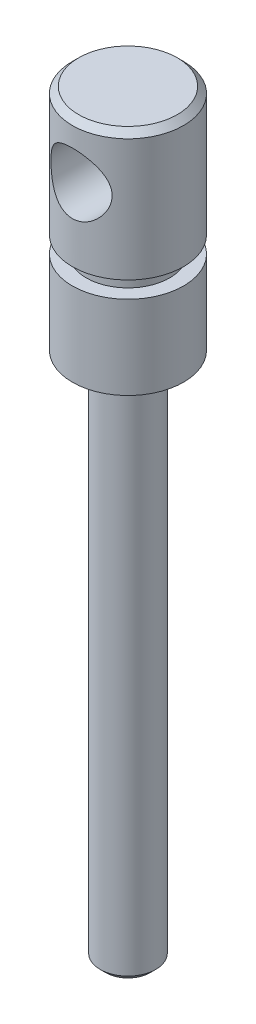
ISO-10303-21;
HEADER;
FILE_DESCRIPTION(('STEP AP214'),'2;1');
FILE_NAME('part.step','',(''),(''),'','','');
FILE_SCHEMA(('AUTOMOTIVE_DESIGN { 1 0 10303 214 1 1 1 1 }'));
ENDSEC;
DATA;
#1=APPLICATION_CONTEXT('core data for automotive mechanical design processes');
#2=APPLICATION_PROTOCOL_DEFINITION('international standard','automotive_design',2000,#1);
#3=PRODUCT_CONTEXT('',#1,'mechanical');
#4=PRODUCT('Part','Part','',(#3));
#5=PRODUCT_RELATED_PRODUCT_CATEGORY('part','',(#4));
#6=PRODUCT_DEFINITION_FORMATION('','',#4);
#7=PRODUCT_DEFINITION_CONTEXT('part definition',#1,'design');
#8=PRODUCT_DEFINITION('design','',#6,#7);
#9=PRODUCT_DEFINITION_SHAPE('','',#8);
#10=(LENGTH_UNIT() NAMED_UNIT(*) SI_UNIT(.MILLI.,.METRE.));
#11=(NAMED_UNIT(*) PLANE_ANGLE_UNIT() SI_UNIT($,.RADIAN.));
#12=(NAMED_UNIT(*) SI_UNIT($,.STERADIAN.) SOLID_ANGLE_UNIT());
#13=UNCERTAINTY_MEASURE_WITH_UNIT(LENGTH_MEASURE(1.E-05),#10,'distance_accuracy_value','');
#14=(GEOMETRIC_REPRESENTATION_CONTEXT(3) GLOBAL_UNCERTAINTY_ASSIGNED_CONTEXT((#13)) GLOBAL_UNIT_ASSIGNED_CONTEXT((#10,
#11,#12)) REPRESENTATION_CONTEXT('',''));
#15=CARTESIAN_POINT('',(0.,0.,0.));
#16=DIRECTION('',(0.,0.,1.));
#17=DIRECTION('',(1.,0.,0.));
#18=AXIS2_PLACEMENT_3D('',#15,#16,#17);
#19=CARTESIAN_POINT('',(0.,0.13,0.));
#20=DIRECTION('',(0.,-1.,0.));
#21=DIRECTION('',(0.,0.,-1.));
#22=AXIS2_PLACEMENT_3D('',#19,#20,#21);
#23=PLANE('',#22);
#24=CARTESIAN_POINT('',(0.,0.13,0.));
#25=DIRECTION('',(0.,-1.,0.));
#26=DIRECTION('',(0.,0.,-1.));
#27=AXIS2_PLACEMENT_3D('',#24,#25,#26);
#28=CIRCLE('',#27,8.86999999999997);
#29=CARTESIAN_POINT('',(0.,0.13,-8.86999999999997));
#30=VERTEX_POINT('',#29);
#31=EDGE_CURVE('E61',#30,#30,#28,.F.);
#32=ORIENTED_EDGE('',*,*,#31,.T.);
#33=EDGE_LOOP('',(#32));
#34=FACE_BOUND('',#33,.T.);
#35=ADVANCED_FACE('F38',(#34),#23,.F.);
#36=CARTESIAN_POINT('',(0.,-23.,0.));
#37=DIRECTION('',(0.,1.,0.));
#38=DIRECTION('',(0.,0.,1.));
#39=AXIS2_PLACEMENT_3D('',#36,#37,#38);
#40=CYLINDRICAL_SURFACE('',#39,10.);
#41=CARTESIAN_POINT('',(0.,-4.5,-10.));
#42=CARTESIAN_POINT('',(0.142841752058878,-4.49999850019387,-10.0000013253171));
#43=CARTESIAN_POINT('',(0.285665986079781,-4.50556976328347,-9.9969335195706));
#44=CARTESIAN_POINT('',(0.570239689293179,-4.52777963257996,-9.98474372414085));
#45=CARTESIAN_POINT('',(0.711988829035868,-4.54442150283317,-9.97561994892361));
#46=CARTESIAN_POINT('',(0.993411840442093,-4.58858219680576,-9.95153761632946));
#47=CARTESIAN_POINT('',(1.1330835984815,-4.61611140422938,-9.9365734889463));
#48=CARTESIAN_POINT('',(1.40927178286025,-4.68171923059871,-9.9011791338125));
#49=CARTESIAN_POINT('',(1.54578689583191,-4.71980215795051,-9.88074667380979));
#50=CARTESIAN_POINT('',(1.81410275102406,-4.80588917672703,-9.83501204865348));
#51=CARTESIAN_POINT('',(1.94592224152469,-4.85384697089414,-9.80973264463814));
#52=CARTESIAN_POINT('',(2.20476755536611,-4.95930983666868,-9.75482138133249));
#53=CARTESIAN_POINT('',(2.33179154281556,-5.01681852011033,-9.72518787595395));
#54=CARTESIAN_POINT('',(2.70454712408485,-5.20287226428519,-9.63072907142522));
#55=CARTESIAN_POINT('',(2.94222352099017,-5.34502983412092,-9.56029904906485));
#56=CARTESIAN_POINT('',(3.40709885210692,-5.67240495150373,-9.40510071299984));
#57=CARTESIAN_POINT('',(3.63245231290911,-5.85991191186389,-9.31967934451281));
#58=CARTESIAN_POINT('',(4.05027005649351,-6.26761851241972,-9.14585008459779));
#59=CARTESIAN_POINT('',(4.24270359328259,-6.48784835981978,-9.05743949262799));
#60=CARTESIAN_POINT('',(4.60842590708714,-6.98081944082922,-8.87738336369874));
#61=CARTESIAN_POINT('',(4.77796075069635,-7.25659650259854,-8.78627724878626));
#62=CARTESIAN_POINT('',(4.99508838788049,-7.69229574182051,-8.6634891383539));
#63=CARTESIAN_POINT('',(5.06128412115967,-7.84125363313554,-8.6248612077339));
#64=CARTESIAN_POINT('',(5.1805658273668,-8.14570391878355,-8.55374495363447));
#65=CARTESIAN_POINT('',(5.23366028561748,-8.30119200691545,-8.52125265949637));
#66=CARTESIAN_POINT('',(5.32309800232022,-8.60769824603289,-8.46565009064031));
#67=CARTESIAN_POINT('',(5.3602810293766,-8.75838806881627,-8.4420802476158));
#68=CARTESIAN_POINT('',(5.42187353079098,-9.06327700232522,-8.40265611303222));
#69=CARTESIAN_POINT('',(5.4462905446175,-9.2174739854766,-8.38679726783014));
#70=CARTESIAN_POINT('',(5.48192299182762,-9.52787509750639,-8.36355045676607));
#71=CARTESIAN_POINT('',(5.49315107892035,-9.68407715694516,-8.35615437174649));
#72=CARTESIAN_POINT('',(5.50222552899403,-9.99702904786448,-8.35018254815687));
#73=CARTESIAN_POINT('',(5.50007372257812,-10.1537788014781,-8.35160560297439));
#74=CARTESIAN_POINT('',(5.48378840679718,-10.4423238070741,-8.362304177594));
#75=CARTESIAN_POINT('',(5.47153363404035,-10.5742765234424,-8.37034812856275));
#76=CARTESIAN_POINT('',(5.43762330738641,-10.8365015697627,-8.39241700242708));
#77=CARTESIAN_POINT('',(5.41596489317585,-10.9667733760064,-8.40644374509048));
#78=CARTESIAN_POINT('',(5.3635189397094,-11.2247394112197,-8.44000182353256));
#79=CARTESIAN_POINT('',(5.3327314211979,-11.3524336460458,-8.45953314680297));
#80=CARTESIAN_POINT('',(5.26237647986399,-11.604539228811,-8.50347627264488));
#81=CARTESIAN_POINT('',(5.22280555536868,-11.7289492452378,-8.52789002130324));
#82=CARTESIAN_POINT('',(5.08962534035009,-12.1014586579969,-8.60852268821012));
#83=CARTESIAN_POINT('',(4.98264689654881,-12.3434858659304,-8.67139237679696));
#84=CARTESIAN_POINT('',(4.73690186702311,-12.8072783466794,-8.80803472474407));
#85=CARTESIAN_POINT('',(4.59812156040827,-13.0290348157599,-8.88181208532226));
#86=CARTESIAN_POINT('',(4.2672928416758,-13.4829626086818,-9.04596391719774));
#87=CARTESIAN_POINT('',(4.07029459887438,-13.7112562928674,-9.13712038619752));
#88=CARTESIAN_POINT('',(3.6407717221147,-14.1334525036102,-9.31659078642609));
#89=CARTESIAN_POINT('',(3.40822298418385,-14.3273315020843,-9.40490273945531));
#90=CARTESIAN_POINT('',(3.02769936677207,-14.5944831341532,-9.53166449287198));
#91=CARTESIAN_POINT('',(2.89078692652741,-14.6818679349817,-9.5741788439289));
#92=CARTESIAN_POINT('',(2.60880759779843,-14.8446455979222,-9.65482165281564));
#93=CARTESIAN_POINT('',(2.46374422978986,-14.9200435842003,-9.69295198280235));
#94=CARTESIAN_POINT('',(2.16643764569558,-15.0580031092139,-9.76370281263216));
#95=CARTESIAN_POINT('',(2.01419808546738,-15.1205710990037,-9.79632608001704));
#96=CARTESIAN_POINT('',(1.70360443439009,-15.2321070292491,-9.85508466904527));
#97=CARTESIAN_POINT('',(1.54525121703053,-15.2810769044065,-9.88122091358791));
#98=CARTESIAN_POINT('',(1.23876719934142,-15.3607969685821,-9.92406797790065));
#99=CARTESIAN_POINT('',(1.09105745977757,-15.3928190643549,-9.94142981891384));
#100=CARTESIAN_POINT('',(0.792902539913914,-15.4446481084313,-9.96963983396893));
#101=CARTESIAN_POINT('',(0.642457675275715,-15.4644564572292,-9.98048875481365));
#102=CARTESIAN_POINT('',(0.340185751134489,-15.4915652616398,-9.99535695727727));
#103=CARTESIAN_POINT('',(0.188359431905525,-15.4988720604122,-9.99937970241998));
#104=CARTESIAN_POINT('',(-0.115397784685615,-15.5008859641353,-10.000487212106));
#105=CARTESIAN_POINT('',(-0.267328674645216,-15.4955938843381,-9.99757242556526));
#106=CARTESIAN_POINT('',(-0.555090017146402,-15.4736288472659,-9.98551656359033));
#107=CARTESIAN_POINT('',(-0.691038404175576,-15.458122734434,-9.97701403759353));
#108=CARTESIAN_POINT('',(-0.961013435543871,-15.4171117329113,-9.95463729187315));
#109=CARTESIAN_POINT('',(-1.09503946994524,-15.3916037404492,-9.94076140471112));
#110=CARTESIAN_POINT('',(-1.36019343131532,-15.3308881062874,-9.90796226724198));
#111=CARTESIAN_POINT('',(-1.49132227054391,-15.2956835662156,-9.88904063097659));
#112=CARTESIAN_POINT('',(-1.74998258370257,-15.2159263412598,-9.8465602681033));
#113=CARTESIAN_POINT('',(-1.87751263214374,-15.171370009475,-9.82299973269512));
#114=CARTESIAN_POINT('',(-2.13100055929735,-15.0722538934694,-9.77117873265241));
#115=CARTESIAN_POINT('',(-2.25686186442489,-15.0174953062352,-9.74282613973581));
#116=CARTESIAN_POINT('',(-2.50344497450166,-14.8991310762515,-9.68240175637615));
#117=CARTESIAN_POINT('',(-2.62416502847458,-14.8355224503868,-9.65032871247552));
#118=CARTESIAN_POINT('',(-2.97774605394808,-14.6321600515731,-9.54950153528061));
#119=CARTESIAN_POINT('',(-3.20217216376082,-14.479812789945,-9.47610871849305));
#120=CARTESIAN_POINT('',(-3.64857882136404,-14.1264715796,-9.31399109156981));
#121=CARTESIAN_POINT('',(-3.86747318592924,-13.921941051183,-9.22446967649404));
#122=CARTESIAN_POINT('',(-4.16880320735541,-13.5907416514808,-9.09028347654795));
#123=CARTESIAN_POINT('',(-4.26481547517286,-13.4761656220196,-9.04553232220247));
#124=CARTESIAN_POINT('',(-4.44742755665807,-13.2392510702113,-8.9571569588291));
#125=CARTESIAN_POINT('',(-4.5340257104432,-13.1169111849557,-8.91353294956809));
#126=CARTESIAN_POINT('',(-4.70364737374316,-12.85515161135,-8.82527898219404));
#127=CARTESIAN_POINT('',(-4.78586336984146,-12.7151442300633,-8.78083658924528));
#128=CARTESIAN_POINT('',(-4.938007141994,-12.4274565011473,-8.6961866776151));
#129=CARTESIAN_POINT('',(-5.00794079563639,-12.279779867639,-8.65597713705672));
#130=CARTESIAN_POINT('',(-5.13475179600474,-11.9776591538154,-8.58135986731129));
#131=CARTESIAN_POINT('',(-5.19164105655858,-11.823221403429,-8.54694685167459));
#132=CARTESIAN_POINT('',(-5.29164807133967,-11.5085422536272,-8.4853944161148));
#133=CARTESIAN_POINT('',(-5.33476840114518,-11.3483019458735,-8.45825363602035));
#134=CARTESIAN_POINT('',(-5.40303118984829,-11.0391483862094,-8.41479223555946));
#135=CARTESIAN_POINT('',(-5.42951066498988,-10.8906418160296,-8.39767807342412));
#136=CARTESIAN_POINT('',(-5.47021149205792,-10.5912680666414,-8.37122340830919));
#137=CARTESIAN_POINT('',(-5.48443375353874,-10.4404010634365,-8.36188232852482));
#138=CARTESIAN_POINT('',(-5.5003578433741,-10.1378320936561,-8.35141637552306));
#139=CARTESIAN_POINT('',(-5.50206881956723,-9.98613081830971,-8.35028549928033));
#140=CARTESIAN_POINT('',(-5.49296232983145,-9.6832787642378,-8.35627878087188));
#141=CARTESIAN_POINT('',(-5.48214589689606,-9.53212794115363,-8.36340225806316));
#142=CARTESIAN_POINT('',(-5.45050665725191,-9.25233409894887,-8.38404884662754));
#143=CARTESIAN_POINT('',(-5.43125166885692,-9.12343564357155,-8.39656541507773));
#144=CARTESIAN_POINT('',(-5.38380329531335,-8.86793643292143,-8.42706636056067));
#145=CARTESIAN_POINT('',(-5.35560704402958,-8.74133642819722,-8.44505249079367));
#146=CARTESIAN_POINT('',(-5.25805956141963,-8.36614667214669,-8.50639672586411));
#147=CARTESIAN_POINT('',(-5.17573170161389,-8.12201288344863,-8.55715312962815));
#148=CARTESIAN_POINT('',(-4.97351417539059,-7.63616312742535,-8.67632720331983));
#149=CARTESIAN_POINT('',(-4.851632703989,-7.39551113769708,-8.74563621099548));
#150=CARTESIAN_POINT('',(-4.57561608218593,-6.93642214235754,-8.89315570661007));
#151=CARTESIAN_POINT('',(-4.42146381549143,-6.71799701751396,-8.9713709082756));
#152=CARTESIAN_POINT('',(-4.05717828293991,-6.27383716290006,-9.14253204899318));
#153=CARTESIAN_POINT('',(-3.84205672204817,-6.05233054284565,-9.235864108763));
#154=CARTESIAN_POINT('',(-3.37593042311172,-5.64702723083797,-9.4162312520407));
#155=CARTESIAN_POINT('',(-3.12490013907636,-5.4632576141827,-9.50326178558824));
#156=CARTESIAN_POINT('',(-2.72071902073227,-5.21734312128358,-9.62385148160563));
#157=CARTESIAN_POINT('',(-2.57870041732792,-5.13926526969409,-9.66296672375161));
#158=CARTESIAN_POINT('',(-2.28727806087811,-4.99553055177587,-9.73606040387869));
#159=CARTESIAN_POINT('',(-2.13787797587978,-4.92986759293369,-9.7700413598182));
#160=CARTESIAN_POINT('',(-1.83300600966548,-4.81186352509766,-9.83179734063237));
#161=CARTESIAN_POINT('',(-1.67754638551483,-4.75949698490882,-9.85958419992875));
#162=CARTESIAN_POINT('',(-1.36162430458018,-4.66868001570659,-9.90815319038245));
#163=CARTESIAN_POINT('',(-1.2011645142698,-4.63022230284775,-9.92893898749869));
#164=CARTESIAN_POINT('',(-0.868435169900309,-4.56622150489788,-9.96369342403182));
#165=CARTESIAN_POINT('',(-0.695978548540532,-4.54142911738252,-9.97726455865953));
#166=CARTESIAN_POINT('',(-0.349005884743478,-4.50831939989647,-9.99541697228057));
#167=CARTESIAN_POINT('',(-0.174489872071037,-4.50000183210425,-9.99999838104469));
#168=CARTESIAN_POINT('',(0.,-4.5,-10.));
#169=B_SPLINE_CURVE_WITH_KNOTS('',3,(#41,#42,#43,#44,#45,#46,#47,#48,#49,#50,#51,#52,#53,#54,
#55,#56,#57,#58,#59,#60,#61,#62,#63,#64,#65,#66,#67,#68,#69,#70,#71,#72,#73,#74,#75,#76,#77,#78,
#79,#80,#81,#82,#83,#84,#85,#86,#87,#88,#89,#90,#91,#92,#93,#94,#95,#96,#97,#98,#99,#100,#101,
#102,#103,#104,#105,#106,#107,#108,#109,#110,#111,#112,#113,#114,#115,#116,#117,#118,#119,#120,
#121,#122,#123,#124,#125,#126,#127,#128,#129,#130,#131,#132,#133,#134,#135,#136,#137,#138,#139,
#140,#141,#142,#143,#144,#145,#146,#147,#148,#149,#150,#151,#152,#153,#154,#155,#156,#157,#158,
#159,#160,#161,#162,#163,#164,#165,#166,#167,#168),.UNSPECIFIED.,.T.,.F.,(4,2,2,2,2,2,2,2,2,2,2,
2,2,2,2,2,2,2,2,2,2,2,2,2,2,2,2,2,2,2,2,2,2,2,2,2,2,2,2,2,2,2,2,2,2,2,2,2,2,2,2,2,2,2,2,2,2,2,2,
2,2,2,2,4),(0.,0.42835450083162,0.856835353269251,1.28572585498715,1.71479170373485,
2.14188994581636,2.56915007181696,3.42284428470344,4.3352646920303,5.24853266826638,
6.25177572751265,6.75372702641161,7.2553523673698,7.72561526965103,8.19560012515658,
8.6651336989287,9.13460303372058,9.53242317074401,9.93036439791497,10.3283047208362,
10.7264039761387,11.5389600350193,12.3518673328937,13.293040231005,14.2348541175191,
14.7379644883097,15.2408592060021,15.743500439655,16.2460701222303,16.7018447273943,
17.1575670612581,17.6130580975835,18.06851966066,18.479320562304,18.8902490442125,
19.301046235061,19.7120039223647,20.1320176181854,20.552173234127,21.3920151581045,
22.3258728342409,22.7936061040557,23.2614217106041,23.7657769639548,24.269890201756,
24.7735411676835,25.2770978667837,25.7318681051628,26.1866045941192,26.6410085614969,
27.0953750619945,27.4877060268678,27.8801628813624,28.6646145595203,29.4971139726443,
30.3300560637595,31.2936579568471,32.2579488115965,32.7575199605934,33.2568453089076,
33.75520831138,34.2533099493803,34.7765785312484,35.299839559441),.UNSPECIFIED.);
#170=CARTESIAN_POINT('',(0.,-4.5,-10.));
#171=VERTEX_POINT('',#170);
#172=EDGE_CURVE('E11',#171,#171,#169,.T.);
#173=ORIENTED_EDGE('',*,*,#172,.F.);
#174=EDGE_LOOP('',(#173));
#175=FACE_BOUND('',#174,.T.);
#176=CARTESIAN_POINT('',(0.,-15.5,10.));
#177=CARTESIAN_POINT('',(0.142841752058878,-15.5000014998061,10.0000013253171));
#178=CARTESIAN_POINT('',(0.285665986079781,-15.4944302367165,9.9969335195706));
#179=CARTESIAN_POINT('',(0.570239689293178,-15.47222036742,9.98474372414085));
#180=CARTESIAN_POINT('',(0.711988829035868,-15.4555784971668,9.97561994892361));
#181=CARTESIAN_POINT('',(0.993411840442093,-15.4114178031942,9.95153761632946));
#182=CARTESIAN_POINT('',(1.1330835984815,-15.3838885957706,9.9365734889463));
#183=CARTESIAN_POINT('',(1.40927178286025,-15.3182807694013,9.9011791338125));
#184=CARTESIAN_POINT('',(1.54578689583191,-15.2801978420495,9.88074667380979));
#185=CARTESIAN_POINT('',(1.81410275102406,-15.194110823273,9.83501204865348));
#186=CARTESIAN_POINT('',(1.9459222415247,-15.1461530291059,9.80973264463814));
#187=CARTESIAN_POINT('',(2.20476755536612,-15.0406901633313,9.75482138133249));
#188=CARTESIAN_POINT('',(2.33179154281557,-14.9831814798897,9.72518787595395));
#189=CARTESIAN_POINT('',(2.70454712408485,-14.7971277357148,9.63072907142522));
#190=CARTESIAN_POINT('',(2.94222352099017,-14.6549701658791,9.56029904906485));
#191=CARTESIAN_POINT('',(3.40709885210692,-14.3275950484963,9.40510071299984));
#192=CARTESIAN_POINT('',(3.63245231290912,-14.1400880881361,9.31967934451281));
#193=CARTESIAN_POINT('',(4.05027005649351,-13.7323814875803,9.14585008459779));
#194=CARTESIAN_POINT('',(4.24270359328259,-13.5121516401802,9.05743949262799));
#195=CARTESIAN_POINT('',(4.60842590708714,-13.0191805591708,8.87738336369874));
#196=CARTESIAN_POINT('',(4.77796075069635,-12.7434034974015,8.78627724878626));
#197=CARTESIAN_POINT('',(4.99508838788049,-12.3077042581795,8.6634891383539));
#198=CARTESIAN_POINT('',(5.06128412115967,-12.1587463668645,8.6248612077339));
#199=CARTESIAN_POINT('',(5.1805658273668,-11.8542960812165,8.55374495363447));
#200=CARTESIAN_POINT('',(5.23366028561748,-11.6988079930846,8.52125265949637));
#201=CARTESIAN_POINT('',(5.32309800232022,-11.3923017539671,8.46565009064031));
#202=CARTESIAN_POINT('',(5.3602810293766,-11.2416119311837,8.44208024761579));
#203=CARTESIAN_POINT('',(5.42187353079098,-10.9367229976748,8.40265611303222));
#204=CARTESIAN_POINT('',(5.4462905446175,-10.7825260145234,8.38679726783014));
#205=CARTESIAN_POINT('',(5.48192299182762,-10.4721249024936,8.36355045676607));
#206=CARTESIAN_POINT('',(5.49315107892035,-10.3159228430548,8.35615437174649));
#207=CARTESIAN_POINT('',(5.50222552899403,-10.0029709521355,8.35018254815687));
#208=CARTESIAN_POINT('',(5.50007372257812,-9.84622119852193,8.35160560297439));
#209=CARTESIAN_POINT('',(5.48378840679718,-9.55767619292588,8.362304177594));
#210=CARTESIAN_POINT('',(5.47153363404035,-9.4257234765576,8.37034812856275));
#211=CARTESIAN_POINT('',(5.43762330738641,-9.16349843023727,8.39241700242708));
#212=CARTESIAN_POINT('',(5.41596489317585,-9.03322662399361,8.40644374509048));
#213=CARTESIAN_POINT('',(5.3635189397094,-8.7752605887803,8.44000182353256));
#214=CARTESIAN_POINT('',(5.3327314211979,-8.64756635395425,8.45953314680297));
#215=CARTESIAN_POINT('',(5.26237647986399,-8.39546077118898,8.50347627264488));
#216=CARTESIAN_POINT('',(5.22280555536868,-8.27105075476222,8.52789002130324));
#217=CARTESIAN_POINT('',(5.08962534035009,-7.89854134200311,8.60852268821013));
#218=CARTESIAN_POINT('',(4.9826468965488,-7.65651413406962,8.67139237679696));
#219=CARTESIAN_POINT('',(4.73690186702311,-7.19272165332061,8.80803472474407));
#220=CARTESIAN_POINT('',(4.59812156040827,-6.97096518424011,8.88181208532226));
#221=CARTESIAN_POINT('',(4.2672928416758,-6.51703739131821,9.04596391719774));
#222=CARTESIAN_POINT('',(4.07029459887438,-6.28874370713259,9.13712038619752));
#223=CARTESIAN_POINT('',(3.6407717221147,-5.86654749638984,9.31659078642609));
#224=CARTESIAN_POINT('',(3.40822298418385,-5.67266849791574,9.40490273945531));
#225=CARTESIAN_POINT('',(3.02769936677207,-5.40551686584682,9.53166449287198));
#226=CARTESIAN_POINT('',(2.89078692652741,-5.31813206501834,9.5741788439289));
#227=CARTESIAN_POINT('',(2.60880759779843,-5.15535440207785,9.65482165281565));
#228=CARTESIAN_POINT('',(2.46374422978986,-5.07995641579975,9.69295198280235));
#229=CARTESIAN_POINT('',(2.16643764569558,-4.94199689078608,9.76370281263216));
#230=CARTESIAN_POINT('',(2.01419808546739,-4.87942890099632,9.79632608001703));
#231=CARTESIAN_POINT('',(1.70360443439009,-4.76789297075095,9.85508466904527));
#232=CARTESIAN_POINT('',(1.54525121703053,-4.71892309559352,9.88122091358791));
#233=CARTESIAN_POINT('',(1.23876719934143,-4.6392030314179,9.92406797790066));
#234=CARTESIAN_POINT('',(1.09105745977757,-4.60718093564513,9.94142981891384));
#235=CARTESIAN_POINT('',(0.792902539913916,-4.55535189156866,9.96963983396893));
#236=CARTESIAN_POINT('',(0.642457675275716,-4.53554354277079,9.98048875481365));
#237=CARTESIAN_POINT('',(0.34018575113449,-4.50843473836024,9.99535695727727));
#238=CARTESIAN_POINT('',(0.188359431905526,-4.50112793958785,9.99937970241998));
#239=CARTESIAN_POINT('',(-0.115397784685615,-4.49911403586467,10.000487212106));
#240=CARTESIAN_POINT('',(-0.267328674645215,-4.50440611566188,9.99757242556526));
#241=CARTESIAN_POINT('',(-0.555090017146401,-4.52637115273406,9.98551656359033));
#242=CARTESIAN_POINT('',(-0.691038404175576,-4.54187726556599,9.97701403759353));
#243=CARTESIAN_POINT('',(-0.961013435543871,-4.58288826708869,9.95463729187315));
#244=CARTESIAN_POINT('',(-1.09503946994524,-4.60839625955085,9.94076140471112));
#245=CARTESIAN_POINT('',(-1.36019343131532,-4.66911189371264,9.90796226724198));
#246=CARTESIAN_POINT('',(-1.49132227054391,-4.70431643378442,9.88904063097659));
#247=CARTESIAN_POINT('',(-1.74998258370257,-4.78407365874023,9.8465602681033));
#248=CARTESIAN_POINT('',(-1.87751263214374,-4.82862999052503,9.82299973269512));
#249=CARTESIAN_POINT('',(-2.13100055929735,-4.92774610653062,9.77117873265241));
#250=CARTESIAN_POINT('',(-2.25686186442489,-4.98250469376485,9.74282613973581));
#251=CARTESIAN_POINT('',(-2.50344497450167,-5.10086892374848,9.68240175637615));
#252=CARTESIAN_POINT('',(-2.62416502847458,-5.16447754961322,9.65032871247552));
#253=CARTESIAN_POINT('',(-2.97774605394808,-5.36783994842687,9.5495015352806));
#254=CARTESIAN_POINT('',(-3.20217216376082,-5.52018721005503,9.47610871849305));
#255=CARTESIAN_POINT('',(-3.64857882136404,-5.8735284204,9.31399109156981));
#256=CARTESIAN_POINT('',(-3.86747318592924,-6.07805894881699,9.22446967649404));
#257=CARTESIAN_POINT('',(-4.16880320735541,-6.40925834851919,9.09028347654795));
#258=CARTESIAN_POINT('',(-4.26481547517286,-6.52383437798036,9.04553232220247));
#259=CARTESIAN_POINT('',(-4.44742755665807,-6.76074892978866,8.9571569588291));
#260=CARTESIAN_POINT('',(-4.5340257104432,-6.88308881504427,8.91353294956809));
#261=CARTESIAN_POINT('',(-4.70364737374316,-7.14484838864995,8.82527898219404));
#262=CARTESIAN_POINT('',(-4.78586336984146,-7.28485576993668,8.78083658924528));
#263=CARTESIAN_POINT('',(-4.938007141994,-7.57254349885269,8.6961866776151));
#264=CARTESIAN_POINT('',(-5.00794079563639,-7.72022013236097,8.65597713705672));
#265=CARTESIAN_POINT('',(-5.13475179600474,-8.02234084618458,8.58135986731129));
#266=CARTESIAN_POINT('',(-5.19164105655858,-8.17677859657105,8.54694685167459));
#267=CARTESIAN_POINT('',(-5.29164807133967,-8.49145774637282,8.4853944161148));
#268=CARTESIAN_POINT('',(-5.33476840114518,-8.65169805412653,8.45825363602035));
#269=CARTESIAN_POINT('',(-5.40303118984829,-8.96085161379061,8.41479223555946));
#270=CARTESIAN_POINT('',(-5.42951066498988,-9.10935818397044,8.39767807342412));
#271=CARTESIAN_POINT('',(-5.47021149205792,-9.40873193335861,8.37122340830919));
#272=CARTESIAN_POINT('',(-5.48443375353874,-9.55959893656349,8.36188232852482));
#273=CARTESIAN_POINT('',(-5.5003578433741,-9.8621679063439,8.35141637552306));
#274=CARTESIAN_POINT('',(-5.50206881956723,-10.0138691816903,8.35028549928033));
#275=CARTESIAN_POINT('',(-5.49296232983145,-10.3167212357622,8.35627878087188));
#276=CARTESIAN_POINT('',(-5.48214589689606,-10.4678720588464,8.36340225806315));
#277=CARTESIAN_POINT('',(-5.45050665725191,-10.7476659010511,8.38404884662754));
#278=CARTESIAN_POINT('',(-5.43125166885693,-10.8765643564285,8.39656541507773));
#279=CARTESIAN_POINT('',(-5.38380329531335,-11.1320635670786,8.42706636056067));
#280=CARTESIAN_POINT('',(-5.35560704402958,-11.2586635718028,8.44505249079367));
#281=CARTESIAN_POINT('',(-5.25805956141963,-11.6338533278533,8.50639672586411));
#282=CARTESIAN_POINT('',(-5.17573170161389,-11.8779871165514,8.55715312962815));
#283=CARTESIAN_POINT('',(-4.9735141753906,-12.3638368725746,8.67632720331983));
#284=CARTESIAN_POINT('',(-4.851632703989,-12.6044888623029,8.74563621099547));
#285=CARTESIAN_POINT('',(-4.57561608218593,-13.0635778576425,8.89315570661007));
#286=CARTESIAN_POINT('',(-4.42146381549143,-13.282002982486,8.9713709082756));
#287=CARTESIAN_POINT('',(-4.05717828293991,-13.7261628370999,9.14253204899318));
#288=CARTESIAN_POINT('',(-3.84205672204817,-13.9476694571544,9.235864108763));
#289=CARTESIAN_POINT('',(-3.37593042311172,-14.352972769162,9.4162312520407));
#290=CARTESIAN_POINT('',(-3.12490013907636,-14.5367423858173,9.50326178558824));
#291=CARTESIAN_POINT('',(-2.72071902073228,-14.7826568787164,9.62385148160562));
#292=CARTESIAN_POINT('',(-2.57870041732792,-14.8607347303059,9.66296672375161));
#293=CARTESIAN_POINT('',(-2.28727806087812,-15.0044694482241,9.73606040387869));
#294=CARTESIAN_POINT('',(-2.13787797587978,-15.0701324070663,9.7700413598182));
#295=CARTESIAN_POINT('',(-1.83300600966548,-15.1881364749023,9.83179734063238));
#296=CARTESIAN_POINT('',(-1.67754638551484,-15.2405030150912,9.85958419992875));
#297=CARTESIAN_POINT('',(-1.36162430458018,-15.3313199842934,9.90815319038245));
#298=CARTESIAN_POINT('',(-1.2011645142698,-15.3697776971522,9.92893898749869));
#299=CARTESIAN_POINT('',(-0.868435169900308,-15.4337784951021,9.96369342403182));
#300=CARTESIAN_POINT('',(-0.69597854854053,-15.4585708826175,9.97726455865953));
#301=CARTESIAN_POINT('',(-0.349005884743477,-15.4916806001035,9.99541697228057));
#302=CARTESIAN_POINT('',(-0.174489872071037,-15.4999981678958,9.99999838104469));
#303=CARTESIAN_POINT('',(0.,-15.5,10.));
#304=B_SPLINE_CURVE_WITH_KNOTS('',3,(#176,#177,#178,#179,#180,#181,#182,#183,#184,#185,#186,
#187,#188,#189,#190,#191,#192,#193,#194,#195,#196,#197,#198,#199,#200,#201,#202,#203,#204,#205,
#206,#207,#208,#209,#210,#211,#212,#213,#214,#215,#216,#217,#218,#219,#220,#221,#222,#223,#224,
#225,#226,#227,#228,#229,#230,#231,#232,#233,#234,#235,#236,#237,#238,#239,#240,#241,#242,#243,
#244,#245,#246,#247,#248,#249,#250,#251,#252,#253,#254,#255,#256,#257,#258,#259,#260,#261,#262,
#263,#264,#265,#266,#267,#268,#269,#270,#271,#272,#273,#274,#275,#276,#277,#278,#279,#280,#281,
#282,#283,#284,#285,#286,#287,#288,#289,#290,#291,#292,#293,#294,#295,#296,#297,#298,#299,#300,
#301,#302,#303),.UNSPECIFIED.,.T.,.F.,(4,2,2,2,2,2,2,2,2,2,2,2,2,2,2,2,2,2,2,2,2,2,2,2,2,2,2,2,
2,2,2,2,2,2,2,2,2,2,2,2,2,2,2,2,2,2,2,2,2,2,2,2,2,2,2,2,2,2,2,2,2,2,2,4),(0.,0.42835450083162,
0.85683535326925,1.28572585498715,1.71479170373485,2.14188994581637,2.56915007181696,
3.42284428470344,4.3352646920303,5.24853266826639,6.25177572751265,6.75372702641161,
7.25535236736979,7.72561526965102,8.19560012515658,8.6651336989287,9.13460303372058,
9.53242317074401,9.93036439791497,10.3283047208362,10.7264039761387,11.5389600350193,
12.3518673328937,13.293040231005,14.2348541175191,14.7379644883097,15.2408592060021,
15.743500439655,16.2460701222303,16.7018447273943,17.1575670612581,17.6130580975835,
18.06851966066,18.479320562304,18.8902490442125,19.301046235061,19.7120039223647,
20.1320176181854,20.552173234127,21.3920151581045,22.3258728342409,22.7936061040557,
23.2614217106041,23.7657769639548,24.269890201756,24.7735411676835,25.2770978667837,
25.7318681051628,26.1866045941192,26.6410085614969,27.0953750619945,27.4877060268677,
27.8801628813624,28.6646145595203,29.4971139726443,30.3300560637595,31.2936579568471,
32.2579488115965,32.7575199605934,33.2568453089076,33.75520831138,34.2533099493803,
34.7765785312483,35.299839559441),.UNSPECIFIED.);
#305=CARTESIAN_POINT('',(0.,-15.5,10.));
#306=VERTEX_POINT('',#305);
#307=EDGE_CURVE('E48',#306,#306,#304,.T.);
#308=ORIENTED_EDGE('',*,*,#307,.F.);
#309=EDGE_LOOP('',(#308));
#310=FACE_BOUND('',#309,.T.);
#311=CARTESIAN_POINT('',(0.,-1.00000000000004,0.));
#312=DIRECTION('',(0.,-1.,0.));
#313=DIRECTION('',(0.,0.,-1.));
#314=AXIS2_PLACEMENT_3D('',#311,#312,#313);
#315=CIRCLE('',#314,10.);
#316=CARTESIAN_POINT('',(0.,-1.00000000000004,-10.));
#317=VERTEX_POINT('',#316);
#318=EDGE_CURVE('E120',#317,#317,#315,.T.);
#319=ORIENTED_EDGE('',*,*,#318,.T.);
#320=EDGE_LOOP('',(#319));
#321=FACE_BOUND('',#320,.T.);
#322=CARTESIAN_POINT('',(0.,-23.,0.));
#323=DIRECTION('',(0.,1.,0.));
#324=DIRECTION('',(0.,0.,1.));
#325=AXIS2_PLACEMENT_3D('',#322,#323,#324);
#326=CIRCLE('',#325,10.);
#327=CARTESIAN_POINT('',(0.,-23.,10.));
#328=VERTEX_POINT('',#327);
#329=EDGE_CURVE('E108',#328,#328,#326,.F.);
#330=ORIENTED_EDGE('',*,*,#329,.F.);
#331=EDGE_LOOP('',(#330));
#332=FACE_BOUND('',#331,.T.);
#333=ADVANCED_FACE('F62',(#175,#310,#321,#332),#40,.T.);
#334=CARTESIAN_POINT('',(0.,-23.,0.));
#335=DIRECTION('',(0.,-1.,0.));
#336=DIRECTION('',(0.,0.,-1.));
#337=AXIS2_PLACEMENT_3D('',#334,#335,#336);
#338=PLANE('',#337);
#339=ORIENTED_EDGE('',*,*,#329,.T.);
#340=EDGE_LOOP('',(#339));
#341=FACE_BOUND('',#340,.T.);
#342=CARTESIAN_POINT('',(0.,-23.,0.));
#343=DIRECTION('',(0.,1.,0.));
#344=DIRECTION('',(0.,0.,1.));
#345=AXIS2_PLACEMENT_3D('',#342,#343,#344);
#346=CIRCLE('',#345,7.5);
#347=CARTESIAN_POINT('',(0.,-23.,7.5));
#348=VERTEX_POINT('',#347);
#349=EDGE_CURVE('E111',#348,#348,#346,.F.);
#350=ORIENTED_EDGE('',*,*,#349,.F.);
#351=EDGE_LOOP('',(#350));
#352=FACE_BOUND('',#351,.T.);
#353=ADVANCED_FACE('F95',(#341,#352),#338,.T.);
#354=CARTESIAN_POINT('',(0.,-26.,0.));
#355=DIRECTION('',(0.,1.,0.));
#356=DIRECTION('',(0.,0.,1.));
#357=AXIS2_PLACEMENT_3D('',#354,#355,#356);
#358=CYLINDRICAL_SURFACE('',#357,7.5);
#359=ORIENTED_EDGE('',*,*,#349,.T.);
#360=EDGE_LOOP('',(#359));
#361=FACE_BOUND('',#360,.T.);
#362=CARTESIAN_POINT('',(0.,-26.,0.));
#363=DIRECTION('',(0.,1.,0.));
#364=DIRECTION('',(0.,0.,1.));
#365=AXIS2_PLACEMENT_3D('',#362,#363,#364);
#366=CIRCLE('',#365,7.5);
#367=CARTESIAN_POINT('',(0.,-26.,7.5));
#368=VERTEX_POINT('',#367);
#369=EDGE_CURVE('E112',#368,#368,#366,.F.);
#370=ORIENTED_EDGE('',*,*,#369,.F.);
#371=EDGE_LOOP('',(#370));
#372=FACE_BOUND('',#371,.T.);
#373=ADVANCED_FACE('F92',(#361,#372),#358,.T.);
#374=CARTESIAN_POINT('',(0.,-26.,0.));
#375=DIRECTION('',(0.,1.,0.));
#376=DIRECTION('',(0.,0.,1.));
#377=AXIS2_PLACEMENT_3D('',#374,#375,#376);
#378=PLANE('',#377);
#379=CARTESIAN_POINT('',(0.,-26.,0.));
#380=DIRECTION('',(0.,1.,0.));
#381=DIRECTION('',(0.,0.,1.));
#382=AXIS2_PLACEMENT_3D('',#379,#380,#381);
#383=CIRCLE('',#382,10.);
#384=CARTESIAN_POINT('',(0.,-26.,10.));
#385=VERTEX_POINT('',#384);
#386=EDGE_CURVE('E115',#385,#385,#383,.F.);
#387=ORIENTED_EDGE('',*,*,#386,.F.);
#388=EDGE_LOOP('',(#387));
#389=FACE_BOUND('',#388,.T.);
#390=ORIENTED_EDGE('',*,*,#369,.T.);
#391=EDGE_LOOP('',(#390));
#392=FACE_BOUND('',#391,.T.);
#393=ADVANCED_FACE('F88',(#389,#392),#378,.T.);
#394=CARTESIAN_POINT('',(0.,-41.,0.));
#395=DIRECTION('',(0.,1.,0.));
#396=DIRECTION('',(0.,0.,1.));
#397=AXIS2_PLACEMENT_3D('',#394,#395,#396);
#398=CYLINDRICAL_SURFACE('',#397,10.);
#399=ORIENTED_EDGE('',*,*,#386,.T.);
#400=EDGE_LOOP('',(#399));
#401=FACE_BOUND('',#400,.T.);
#402=CARTESIAN_POINT('',(0.,-41.,0.));
#403=DIRECTION('',(0.,1.,0.));
#404=DIRECTION('',(0.,0.,1.));
#405=AXIS2_PLACEMENT_3D('',#402,#403,#404);
#406=CIRCLE('',#405,10.);
#407=CARTESIAN_POINT('',(0.,-41.,10.));
#408=VERTEX_POINT('',#407);
#409=EDGE_CURVE('E226',#408,#408,#406,.T.);
#410=ORIENTED_EDGE('',*,*,#409,.T.);
#411=EDGE_LOOP('',(#410));
#412=FACE_BOUND('',#411,.T.);
#413=ADVANCED_FACE('F84',(#401,#412),#398,.T.);
#414=CARTESIAN_POINT('',(0.,-41.,0.));
#415=DIRECTION('',(0.,1.,0.));
#416=DIRECTION('',(0.,0.,1.));
#417=AXIS2_PLACEMENT_3D('',#414,#415,#416);
#418=PLANE('',#417);
#419=ORIENTED_EDGE('',*,*,#409,.F.);
#420=EDGE_LOOP('',(#419));
#421=FACE_BOUND('',#420,.T.);
#422=CARTESIAN_POINT('',(0.,-41.,0.));
#423=DIRECTION('',(0.,1.,0.));
#424=DIRECTION('',(0.,0.,1.));
#425=AXIS2_PLACEMENT_3D('',#422,#423,#424);
#426=CIRCLE('',#425,5.);
#427=CARTESIAN_POINT('',(0.,-41.,5.));
#428=VERTEX_POINT('',#427);
#429=EDGE_CURVE('E123',#428,#428,#426,.F.);
#430=ORIENTED_EDGE('',*,*,#429,.F.);
#431=EDGE_LOOP('',(#430));
#432=FACE_BOUND('',#431,.T.);
#433=ADVANCED_FACE('F80',(#421,#432),#418,.F.);
#434=CARTESIAN_POINT('',(0.,-136.,0.));
#435=DIRECTION('',(0.,1.,0.));
#436=DIRECTION('',(0.,0.,1.));
#437=AXIS2_PLACEMENT_3D('',#434,#435,#436);
#438=PLANE('',#437);
#439=CARTESIAN_POINT('',(0.,-136.,0.));
#440=DIRECTION('',(0.,1.,0.));
#441=DIRECTION('',(0.,0.,1.));
#442=AXIS2_PLACEMENT_3D('',#439,#440,#441);
#443=CIRCLE('',#442,4.00000000000002);
#444=CARTESIAN_POINT('',(0.,-136.,4.00000000000002));
#445=VERTEX_POINT('',#444);
#446=EDGE_CURVE('E52',#445,#445,#443,.F.);
#447=ORIENTED_EDGE('',*,*,#446,.T.);
#448=EDGE_LOOP('',(#447));
#449=FACE_BOUND('',#448,.T.);
#450=ADVANCED_FACE('F76',(#449),#438,.F.);
#451=CARTESIAN_POINT('',(0.,-136.,0.));
#452=DIRECTION('',(0.,1.,0.));
#453=DIRECTION('',(0.,0.,1.));
#454=AXIS2_PLACEMENT_3D('',#451,#452,#453);
#455=CYLINDRICAL_SURFACE('',#454,5.);
#456=CARTESIAN_POINT('',(0.,-135.,0.));
#457=DIRECTION('',(0.,1.,0.));
#458=DIRECTION('',(0.,0.,1.));
#459=AXIS2_PLACEMENT_3D('',#456,#457,#458);
#460=CIRCLE('',#459,5.);
#461=CARTESIAN_POINT('',(0.,-135.,5.));
#462=VERTEX_POINT('',#461);
#463=EDGE_CURVE('E56',#462,#462,#460,.T.);
#464=ORIENTED_EDGE('',*,*,#463,.T.);
#465=EDGE_LOOP('',(#464));
#466=FACE_BOUND('',#465,.T.);
#467=ORIENTED_EDGE('',*,*,#429,.T.);
#468=EDGE_LOOP('',(#467));
#469=FACE_BOUND('',#468,.T.);
#470=ADVANCED_FACE('F71',(#466,#469),#455,.T.);
#471=CARTESIAN_POINT('',(0.,-1.00000000000004,0.));
#472=DIRECTION('',(0.,-1.,0.));
#473=DIRECTION('',(0.,0.,-1.));
#474=AXIS2_PLACEMENT_3D('',#471,#472,#473);
#475=CONICAL_SURFACE('',#474,10.,0.785398163397444);
#476=ORIENTED_EDGE('',*,*,#31,.F.);
#477=EDGE_LOOP('',(#476));
#478=FACE_BOUND('',#477,.T.);
#479=ORIENTED_EDGE('',*,*,#318,.F.);
#480=EDGE_LOOP('',(#479));
#481=FACE_BOUND('',#480,.T.);
#482=ADVANCED_FACE('F75',(#478,#481),#475,.T.);
#483=CARTESIAN_POINT('',(0.,-135.,0.));
#484=DIRECTION('',(0.,1.,0.));
#485=DIRECTION('',(0.,0.,1.));
#486=AXIS2_PLACEMENT_3D('',#483,#484,#485);
#487=CONICAL_SURFACE('',#486,5.,0.785398163397453);
#488=ORIENTED_EDGE('',*,*,#446,.F.);
#489=EDGE_LOOP('',(#488));
#490=FACE_BOUND('',#489,.T.);
#491=ORIENTED_EDGE('',*,*,#463,.F.);
#492=EDGE_LOOP('',(#491));
#493=FACE_BOUND('',#492,.T.);
#494=ADVANCED_FACE('F70',(#490,#493),#487,.T.);
#495=CARTESIAN_POINT('',(0.,-10.,-10.));
#496=DIRECTION('',(0.,0.,1.));
#497=DIRECTION('',(1.,0.,0.));
#498=AXIS2_PLACEMENT_3D('',#495,#496,#497);
#499=CYLINDRICAL_SURFACE('',#498,5.5);
#500=ORIENTED_EDGE('',*,*,#307,.T.);
#501=EDGE_LOOP('',(#500));
#502=FACE_BOUND('',#501,.T.);
#503=ORIENTED_EDGE('',*,*,#172,.T.);
#504=EDGE_LOOP('',(#503));
#505=FACE_BOUND('',#504,.T.);
#506=ADVANCED_FACE('F66',(#502,#505),#499,.F.);
#507=CLOSED_SHELL('',(#35,#333,#353,#373,#393,#413,#433,#450,#470,#482,#494,#506));
#508=MANIFOLD_SOLID_BREP('B2',#507);
#509=ADVANCED_BREP_SHAPE_REPRESENTATION('',(#18,#508),#14);
#510=SHAPE_DEFINITION_REPRESENTATION(#9,#509);
ENDSEC;
END-ISO-10303-21;
